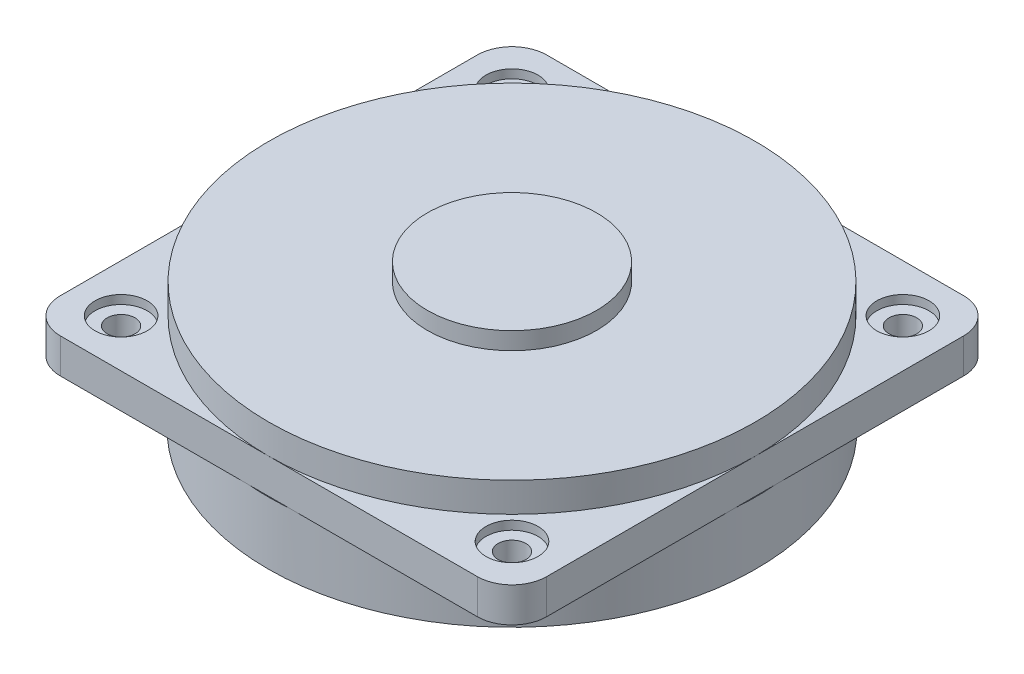
ISO-10303-21;
HEADER;
FILE_DESCRIPTION(('STEP AP214'),'2;1');
FILE_NAME('part.step','',(''),(''),'','','');
FILE_SCHEMA(('AUTOMOTIVE_DESIGN { 1 0 10303 214 1 1 1 1 }'));
ENDSEC;
DATA;
#1=APPLICATION_CONTEXT('core data for automotive mechanical design processes');
#2=APPLICATION_PROTOCOL_DEFINITION('international standard','automotive_design',2000,#1);
#3=PRODUCT_CONTEXT('',#1,'mechanical');
#4=PRODUCT('Part','Part','',(#3));
#5=PRODUCT_RELATED_PRODUCT_CATEGORY('part','',(#4));
#6=PRODUCT_DEFINITION_FORMATION('','',#4);
#7=PRODUCT_DEFINITION_CONTEXT('part definition',#1,'design');
#8=PRODUCT_DEFINITION('design','',#6,#7);
#9=PRODUCT_DEFINITION_SHAPE('','',#8);
#10=(LENGTH_UNIT() NAMED_UNIT(*) SI_UNIT(.MILLI.,.METRE.));
#11=(NAMED_UNIT(*) PLANE_ANGLE_UNIT() SI_UNIT($,.RADIAN.));
#12=(NAMED_UNIT(*) SI_UNIT($,.STERADIAN.) SOLID_ANGLE_UNIT());
#13=UNCERTAINTY_MEASURE_WITH_UNIT(LENGTH_MEASURE(1.E-05),#10,'distance_accuracy_value','');
#14=(GEOMETRIC_REPRESENTATION_CONTEXT(3) GLOBAL_UNCERTAINTY_ASSIGNED_CONTEXT((#13)) GLOBAL_UNIT_ASSIGNED_CONTEXT((#10,
#11,#12)) REPRESENTATION_CONTEXT('',''));
#15=CARTESIAN_POINT('',(0.,0.,0.));
#16=DIRECTION('',(0.,0.,1.));
#17=DIRECTION('',(1.,0.,0.));
#18=AXIS2_PLACEMENT_3D('',#15,#16,#17);
#19=CARTESIAN_POINT('',(0.,2.,0.));
#20=DIRECTION('',(0.,1.,0.));
#21=DIRECTION('',(0.,0.,1.));
#22=AXIS2_PLACEMENT_3D('',#19,#20,#21);
#23=PLANE('',#22);
#24=CARTESIAN_POINT('',(11.25,2.,11.25));
#25=DIRECTION('',(0.,1.,0.));
#26=DIRECTION('',(0.,0.,1.));
#27=AXIS2_PLACEMENT_3D('',#24,#25,#26);
#28=CIRCLE('',#27,1.5);
#29=CARTESIAN_POINT('',(11.25,2.,12.75));
#30=VERTEX_POINT('',#29);
#31=EDGE_CURVE('E239',#30,#30,#28,.T.);
#32=ORIENTED_EDGE('',*,*,#31,.F.);
#33=EDGE_LOOP('',(#32));
#34=FACE_BOUND('',#33,.T.);
#35=DIRECTION('',(1.,0.,0.));
#36=VECTOR('',#35,1.);
#37=CARTESIAN_POINT('',(-14.,2.,14.));
#38=LINE('',#37,#36);
#39=CARTESIAN_POINT('',(0.,2.,14.));
#40=VERTEX_POINT('',#39);
#41=CARTESIAN_POINT('',(12.,2.,14.));
#42=VERTEX_POINT('',#41);
#43=EDGE_CURVE('E150',#40,#42,#38,.T.);
#44=ORIENTED_EDGE('',*,*,#43,.T.);
#45=CARTESIAN_POINT('',(12.,2.,12.));
#46=DIRECTION('',(0.,1.,0.));
#47=DIRECTION('',(0.,0.,1.));
#48=AXIS2_PLACEMENT_3D('',#45,#46,#47);
#49=CIRCLE('',#48,2.);
#50=CARTESIAN_POINT('',(14.,2.,12.));
#51=VERTEX_POINT('',#50);
#52=EDGE_CURVE('E258',#42,#51,#49,.T.);
#53=ORIENTED_EDGE('',*,*,#52,.T.);
#54=DIRECTION('',(0.,0.,-1.));
#55=VECTOR('',#54,1.);
#56=CARTESIAN_POINT('',(14.,2.,-14.));
#57=LINE('',#56,#55);
#58=CARTESIAN_POINT('',(14.,2.,0.));
#59=VERTEX_POINT('',#58);
#60=EDGE_CURVE('E164',#51,#59,#57,.T.);
#61=ORIENTED_EDGE('',*,*,#60,.T.);
#62=CARTESIAN_POINT('',(0.,2.,0.));
#63=DIRECTION('',(0.,1.,0.));
#64=DIRECTION('',(0.,0.,1.));
#65=AXIS2_PLACEMENT_3D('',#62,#63,#64);
#66=CIRCLE('',#65,14.);
#67=EDGE_CURVE('E162',#40,#59,#66,.T.);
#68=ORIENTED_EDGE('',*,*,#67,.F.);
#69=EDGE_LOOP('',(#44,#53,#61,#68));
#70=FACE_BOUND('',#69,.T.);
#71=ADVANCED_FACE('F35',(#34,#70),#23,.T.);
#72=CARTESIAN_POINT('',(11.25,2.,-11.25));
#73=DIRECTION('',(0.,1.,0.));
#74=DIRECTION('',(0.,0.,1.));
#75=AXIS2_PLACEMENT_3D('',#72,#73,#74);
#76=CIRCLE('',#75,1.5);
#77=CARTESIAN_POINT('',(11.25,2.,-9.75));
#78=VERTEX_POINT('',#77);
#79=EDGE_CURVE('E363',#78,#78,#76,.T.);
#80=ORIENTED_EDGE('',*,*,#79,.F.);
#81=EDGE_LOOP('',(#80));
#82=FACE_BOUND('',#81,.T.);
#83=CARTESIAN_POINT('',(14.,2.,-12.));
#84=VERTEX_POINT('',#83);
#85=EDGE_CURVE('E203',#59,#84,#57,.T.);
#86=ORIENTED_EDGE('',*,*,#85,.T.);
#87=CARTESIAN_POINT('',(12.,2.,-12.));
#88=DIRECTION('',(0.,1.,0.));
#89=DIRECTION('',(0.,0.,1.));
#90=AXIS2_PLACEMENT_3D('',#87,#88,#89);
#91=CIRCLE('',#90,2.);
#92=CARTESIAN_POINT('',(12.,2.,-14.));
#93=VERTEX_POINT('',#92);
#94=EDGE_CURVE('E12',#84,#93,#91,.T.);
#95=ORIENTED_EDGE('',*,*,#94,.T.);
#96=DIRECTION('',(-1.,0.,0.));
#97=VECTOR('',#96,1.);
#98=CARTESIAN_POINT('',(-14.,2.,-14.));
#99=LINE('',#98,#97);
#100=CARTESIAN_POINT('',(0.,2.,-14.));
#101=VERTEX_POINT('',#100);
#102=EDGE_CURVE('E204',#93,#101,#99,.T.);
#103=ORIENTED_EDGE('',*,*,#102,.T.);
#104=EDGE_CURVE('E171',#59,#101,#66,.T.);
#105=ORIENTED_EDGE('',*,*,#104,.F.);
#106=EDGE_LOOP('',(#86,#95,#103,#105));
#107=FACE_BOUND('',#106,.T.);
#108=ADVANCED_FACE('F282',(#82,#107),#23,.T.);
#109=CARTESIAN_POINT('',(-11.25,2.,-11.25));
#110=DIRECTION('',(0.,1.,0.));
#111=DIRECTION('',(0.,0.,1.));
#112=AXIS2_PLACEMENT_3D('',#109,#110,#111);
#113=CIRCLE('',#112,1.5);
#114=CARTESIAN_POINT('',(-11.25,2.,-9.75));
#115=VERTEX_POINT('',#114);
#116=EDGE_CURVE('E357',#115,#115,#113,.T.);
#117=ORIENTED_EDGE('',*,*,#116,.F.);
#118=EDGE_LOOP('',(#117));
#119=FACE_BOUND('',#118,.T.);
#120=CARTESIAN_POINT('',(-12.,2.,-14.));
#121=VERTEX_POINT('',#120);
#122=EDGE_CURVE('E202',#101,#121,#99,.T.);
#123=ORIENTED_EDGE('',*,*,#122,.T.);
#124=CARTESIAN_POINT('',(-12.,2.,-12.));
#125=DIRECTION('',(0.,1.,0.));
#126=DIRECTION('',(0.,0.,1.));
#127=AXIS2_PLACEMENT_3D('',#124,#125,#126);
#128=CIRCLE('',#127,2.);
#129=CARTESIAN_POINT('',(-14.,2.,-12.));
#130=VERTEX_POINT('',#129);
#131=EDGE_CURVE('E266',#121,#130,#128,.T.);
#132=ORIENTED_EDGE('',*,*,#131,.T.);
#133=DIRECTION('',(0.,0.,1.));
#134=VECTOR('',#133,1.);
#135=CARTESIAN_POINT('',(-14.,2.,-14.));
#136=LINE('',#135,#134);
#137=CARTESIAN_POINT('',(-14.,2.,0.));
#138=VERTEX_POINT('',#137);
#139=EDGE_CURVE('E160',#130,#138,#136,.T.);
#140=ORIENTED_EDGE('',*,*,#139,.T.);
#141=EDGE_CURVE('E176',#101,#138,#66,.T.);
#142=ORIENTED_EDGE('',*,*,#141,.F.);
#143=EDGE_LOOP('',(#123,#132,#140,#142));
#144=FACE_BOUND('',#143,.T.);
#145=ADVANCED_FACE('F284',(#119,#144),#23,.T.);
#146=CARTESIAN_POINT('',(0.,0.,0.));
#147=DIRECTION('',(0.,1.,0.));
#148=DIRECTION('',(0.,0.,1.));
#149=AXIS2_PLACEMENT_3D('',#146,#147,#148);
#150=PLANE('',#149);
#151=CARTESIAN_POINT('',(11.25,0.,-11.25));
#152=DIRECTION('',(0.,1.,0.));
#153=DIRECTION('',(0.,0.,1.));
#154=AXIS2_PLACEMENT_3D('',#151,#152,#153);
#155=CIRCLE('',#154,0.800000000000001);
#156=CARTESIAN_POINT('',(11.25,0.,-10.45));
#157=VERTEX_POINT('',#156);
#158=EDGE_CURVE('E236',#157,#157,#155,.T.);
#159=ORIENTED_EDGE('',*,*,#158,.T.);
#160=EDGE_LOOP('',(#159));
#161=FACE_BOUND('',#160,.T.);
#162=DIRECTION('',(-1.,0.,0.));
#163=VECTOR('',#162,1.);
#164=CARTESIAN_POINT('',(-14.,0.,-14.));
#165=LINE('',#164,#163);
#166=CARTESIAN_POINT('',(12.,0.,-14.));
#167=VERTEX_POINT('',#166);
#168=CARTESIAN_POINT('',(1.12339886060117,0.,-14.));
#169=VERTEX_POINT('',#168);
#170=EDGE_CURVE('E212',#167,#169,#165,.T.);
#171=ORIENTED_EDGE('',*,*,#170,.F.);
#172=CARTESIAN_POINT('',(12.,0.,-12.));
#173=DIRECTION('',(0.,1.,0.));
#174=DIRECTION('',(0.,0.,1.));
#175=AXIS2_PLACEMENT_3D('',#172,#173,#174);
#176=CIRCLE('',#175,2.);
#177=CARTESIAN_POINT('',(14.,0.,-12.));
#178=VERTEX_POINT('',#177);
#179=EDGE_CURVE('E43',#167,#178,#176,.F.);
#180=ORIENTED_EDGE('',*,*,#179,.T.);
#181=DIRECTION('',(0.,0.,-1.));
#182=VECTOR('',#181,1.);
#183=CARTESIAN_POINT('',(14.,0.,-14.));
#184=LINE('',#183,#182);
#185=CARTESIAN_POINT('',(14.,0.,-1.12339886060117));
#186=VERTEX_POINT('',#185);
#187=EDGE_CURVE('E200',#186,#178,#184,.T.);
#188=ORIENTED_EDGE('',*,*,#187,.F.);
#189=CARTESIAN_POINT('',(0.,0.,0.));
#190=DIRECTION('',(0.,-1.,0.));
#191=DIRECTION('',(0.,0.,-1.));
#192=AXIS2_PLACEMENT_3D('',#189,#190,#191);
#193=CIRCLE('',#192,14.045);
#194=EDGE_CURVE('E188',#169,#186,#193,.T.);
#195=ORIENTED_EDGE('',*,*,#194,.F.);
#196=EDGE_LOOP('',(#171,#180,#188,#195));
#197=FACE_BOUND('',#196,.T.);
#198=ADVANCED_FACE('F270',(#161,#197),#150,.F.);
#199=CARTESIAN_POINT('',(11.25,0.,11.25));
#200=DIRECTION('',(0.,1.,0.));
#201=DIRECTION('',(0.,0.,1.));
#202=AXIS2_PLACEMENT_3D('',#199,#200,#201);
#203=CIRCLE('',#202,0.800000000000001);
#204=CARTESIAN_POINT('',(11.25,0.,12.05));
#205=VERTEX_POINT('',#204);
#206=EDGE_CURVE('E233',#205,#205,#203,.T.);
#207=ORIENTED_EDGE('',*,*,#206,.T.);
#208=EDGE_LOOP('',(#207));
#209=FACE_BOUND('',#208,.T.);
#210=CARTESIAN_POINT('',(14.,0.,12.));
#211=VERTEX_POINT('',#210);
#212=CARTESIAN_POINT('',(14.,0.,1.12339886060117));
#213=VERTEX_POINT('',#212);
#214=EDGE_CURVE('E208',#211,#213,#184,.T.);
#215=ORIENTED_EDGE('',*,*,#214,.F.);
#216=CARTESIAN_POINT('',(12.,0.,12.));
#217=DIRECTION('',(0.,1.,0.));
#218=DIRECTION('',(0.,0.,1.));
#219=AXIS2_PLACEMENT_3D('',#216,#217,#218);
#220=CIRCLE('',#219,2.);
#221=CARTESIAN_POINT('',(12.,0.,14.));
#222=VERTEX_POINT('',#221);
#223=EDGE_CURVE('E256',#211,#222,#220,.F.);
#224=ORIENTED_EDGE('',*,*,#223,.T.);
#225=DIRECTION('',(1.,0.,0.));
#226=VECTOR('',#225,1.);
#227=CARTESIAN_POINT('',(-14.,0.,14.));
#228=LINE('',#227,#226);
#229=CARTESIAN_POINT('',(1.12339886060121,0.,14.));
#230=VERTEX_POINT('',#229);
#231=EDGE_CURVE('E218',#230,#222,#228,.T.);
#232=ORIENTED_EDGE('',*,*,#231,.F.);
#233=EDGE_CURVE('E177',#213,#230,#193,.T.);
#234=ORIENTED_EDGE('',*,*,#233,.F.);
#235=EDGE_LOOP('',(#215,#224,#232,#234));
#236=FACE_BOUND('',#235,.T.);
#237=ADVANCED_FACE('F353',(#209,#236),#150,.F.);
#238=CARTESIAN_POINT('',(-11.25,0.,11.25));
#239=DIRECTION('',(0.,1.,0.));
#240=DIRECTION('',(0.,0.,1.));
#241=AXIS2_PLACEMENT_3D('',#238,#239,#240);
#242=CIRCLE('',#241,0.800000000000001);
#243=CARTESIAN_POINT('',(-11.25,0.,12.05));
#244=VERTEX_POINT('',#243);
#245=EDGE_CURVE('E229',#244,#244,#242,.T.);
#246=ORIENTED_EDGE('',*,*,#245,.T.);
#247=EDGE_LOOP('',(#246));
#248=FACE_BOUND('',#247,.T.);
#249=CARTESIAN_POINT('',(-12.,0.,14.));
#250=VERTEX_POINT('',#249);
#251=CARTESIAN_POINT('',(-1.12339886060121,0.,14.));
#252=VERTEX_POINT('',#251);
#253=EDGE_CURVE('E220',#250,#252,#228,.T.);
#254=ORIENTED_EDGE('',*,*,#253,.F.);
#255=CARTESIAN_POINT('',(-12.,0.,12.));
#256=DIRECTION('',(0.,1.,0.));
#257=DIRECTION('',(0.,0.,1.));
#258=AXIS2_PLACEMENT_3D('',#255,#256,#257);
#259=CIRCLE('',#258,2.);
#260=CARTESIAN_POINT('',(-14.,0.,12.));
#261=VERTEX_POINT('',#260);
#262=EDGE_CURVE('E243',#250,#261,#259,.F.);
#263=ORIENTED_EDGE('',*,*,#262,.T.);
#264=DIRECTION('',(0.,0.,1.));
#265=VECTOR('',#264,1.);
#266=CARTESIAN_POINT('',(-14.,0.,-14.));
#267=LINE('',#266,#265);
#268=CARTESIAN_POINT('',(-14.,0.,1.12339886060117));
#269=VERTEX_POINT('',#268);
#270=EDGE_CURVE('E214',#269,#261,#267,.T.);
#271=ORIENTED_EDGE('',*,*,#270,.F.);
#272=EDGE_CURVE('E179',#252,#269,#193,.T.);
#273=ORIENTED_EDGE('',*,*,#272,.F.);
#274=EDGE_LOOP('',(#254,#263,#271,#273));
#275=FACE_BOUND('',#274,.T.);
#276=ADVANCED_FACE('F407',(#248,#275),#150,.F.);
#277=CARTESIAN_POINT('',(14.,2.,-14.));
#278=DIRECTION('',(-1.,0.,0.));
#279=DIRECTION('',(0.,0.,1.));
#280=AXIS2_PLACEMENT_3D('',#277,#278,#279);
#281=PLANE('',#280);
#282=ORIENTED_EDGE('',*,*,#60,.F.);
#283=DIRECTION('',(0.,-1.,0.));
#284=VECTOR('',#283,1.);
#285=CARTESIAN_POINT('',(14.,2.,12.));
#286=LINE('',#285,#284);
#287=EDGE_CURVE('E253',#51,#211,#286,.T.);
#288=ORIENTED_EDGE('',*,*,#287,.T.);
#289=ORIENTED_EDGE('',*,*,#214,.T.);
#290=EDGE_CURVE('E211',#213,#186,#184,.T.);
#291=ORIENTED_EDGE('',*,*,#290,.T.);
#292=ORIENTED_EDGE('',*,*,#187,.T.);
#293=DIRECTION('',(0.,-1.,0.));
#294=VECTOR('',#293,1.);
#295=CARTESIAN_POINT('',(14.,2.,-12.));
#296=LINE('',#295,#294);
#297=EDGE_CURVE('E251',#178,#84,#296,.F.);
#298=ORIENTED_EDGE('',*,*,#297,.T.);
#299=ORIENTED_EDGE('',*,*,#85,.F.);
#300=EDGE_LOOP('',(#282,#288,#289,#291,#292,#298,#299));
#301=FACE_BOUND('',#300,.T.);
#302=ADVANCED_FACE('F277',(#301),#281,.F.);
#303=CARTESIAN_POINT('',(-14.,2.,-14.));
#304=DIRECTION('',(0.,0.,1.));
#305=DIRECTION('',(1.,0.,0.));
#306=AXIS2_PLACEMENT_3D('',#303,#304,#305);
#307=PLANE('',#306);
#308=CARTESIAN_POINT('',(-1.12339886060117,0.,-14.));
#309=VERTEX_POINT('',#308);
#310=CARTESIAN_POINT('',(-12.,0.,-14.));
#311=VERTEX_POINT('',#310);
#312=EDGE_CURVE('E210',#309,#311,#165,.T.);
#313=ORIENTED_EDGE('',*,*,#312,.T.);
#314=DIRECTION('',(0.,-1.,0.));
#315=VECTOR('',#314,1.);
#316=CARTESIAN_POINT('',(-12.,2.,-14.));
#317=LINE('',#316,#315);
#318=EDGE_CURVE('E56',#311,#121,#317,.F.);
#319=ORIENTED_EDGE('',*,*,#318,.T.);
#320=ORIENTED_EDGE('',*,*,#122,.F.);
#321=ORIENTED_EDGE('',*,*,#102,.F.);
#322=DIRECTION('',(0.,-1.,0.));
#323=VECTOR('',#322,1.);
#324=CARTESIAN_POINT('',(12.,2.,-14.));
#325=LINE('',#324,#323);
#326=EDGE_CURVE('E262',#93,#167,#325,.T.);
#327=ORIENTED_EDGE('',*,*,#326,.T.);
#328=ORIENTED_EDGE('',*,*,#170,.T.);
#329=EDGE_CURVE('E215',#169,#309,#165,.T.);
#330=ORIENTED_EDGE('',*,*,#329,.T.);
#331=EDGE_LOOP('',(#313,#319,#320,#321,#327,#328,#330));
#332=FACE_BOUND('',#331,.T.);
#333=ADVANCED_FACE('F281',(#332),#307,.F.);
#334=CARTESIAN_POINT('',(-14.,2.,-14.));
#335=DIRECTION('',(1.,0.,0.));
#336=DIRECTION('',(0.,0.,-1.));
#337=AXIS2_PLACEMENT_3D('',#334,#335,#336);
#338=PLANE('',#337);
#339=ORIENTED_EDGE('',*,*,#270,.T.);
#340=DIRECTION('',(0.,-1.,0.));
#341=VECTOR('',#340,1.);
#342=CARTESIAN_POINT('',(-14.,2.,12.));
#343=LINE('',#342,#341);
#344=CARTESIAN_POINT('',(-14.,2.,12.));
#345=VERTEX_POINT('',#344);
#346=EDGE_CURVE('E248',#261,#345,#343,.F.);
#347=ORIENTED_EDGE('',*,*,#346,.T.);
#348=EDGE_CURVE('E206',#138,#345,#136,.T.);
#349=ORIENTED_EDGE('',*,*,#348,.F.);
#350=ORIENTED_EDGE('',*,*,#139,.F.);
#351=DIRECTION('',(0.,-1.,0.));
#352=VECTOR('',#351,1.);
#353=CARTESIAN_POINT('',(-14.,2.,-12.));
#354=LINE('',#353,#352);
#355=CARTESIAN_POINT('',(-14.,0.,-12.));
#356=VERTEX_POINT('',#355);
#357=EDGE_CURVE('E245',#130,#356,#354,.T.);
#358=ORIENTED_EDGE('',*,*,#357,.T.);
#359=CARTESIAN_POINT('',(-14.,0.,-1.12339886060117));
#360=VERTEX_POINT('',#359);
#361=EDGE_CURVE('E216',#356,#360,#267,.T.);
#362=ORIENTED_EDGE('',*,*,#361,.T.);
#363=EDGE_CURVE('E219',#360,#269,#267,.T.);
#364=ORIENTED_EDGE('',*,*,#363,.T.);
#365=EDGE_LOOP('',(#339,#347,#349,#350,#358,#362,#364));
#366=FACE_BOUND('',#365,.T.);
#367=ADVANCED_FACE('F290',(#366),#338,.F.);
#368=CARTESIAN_POINT('',(-14.,2.,14.));
#369=DIRECTION('',(0.,0.,-1.));
#370=DIRECTION('',(-1.,0.,0.));
#371=AXIS2_PLACEMENT_3D('',#368,#369,#370);
#372=PLANE('',#371);
#373=CARTESIAN_POINT('',(-12.,2.,14.));
#374=VERTEX_POINT('',#373);
#375=EDGE_CURVE('E137',#374,#40,#38,.T.);
#376=ORIENTED_EDGE('',*,*,#375,.F.);
#377=DIRECTION('',(0.,-1.,0.));
#378=VECTOR('',#377,1.);
#379=CARTESIAN_POINT('',(-12.,2.,14.));
#380=LINE('',#379,#378);
#381=EDGE_CURVE('E241',#374,#250,#380,.T.);
#382=ORIENTED_EDGE('',*,*,#381,.T.);
#383=ORIENTED_EDGE('',*,*,#253,.T.);
#384=EDGE_CURVE('E222',#252,#230,#228,.T.);
#385=ORIENTED_EDGE('',*,*,#384,.T.);
#386=ORIENTED_EDGE('',*,*,#231,.T.);
#387=DIRECTION('',(0.,-1.,0.));
#388=VECTOR('',#387,1.);
#389=CARTESIAN_POINT('',(12.,2.,14.));
#390=LINE('',#389,#388);
#391=EDGE_CURVE('E157',#222,#42,#390,.F.);
#392=ORIENTED_EDGE('',*,*,#391,.T.);
#393=ORIENTED_EDGE('',*,*,#43,.F.);
#394=EDGE_LOOP('',(#376,#382,#383,#385,#386,#392,#393));
#395=FACE_BOUND('',#394,.T.);
#396=ADVANCED_FACE('F154',(#395),#372,.F.);
#397=CARTESIAN_POINT('',(-11.25,2.,11.25));
#398=DIRECTION('',(0.,1.,0.));
#399=DIRECTION('',(0.,0.,1.));
#400=AXIS2_PLACEMENT_3D('',#397,#398,#399);
#401=CIRCLE('',#400,1.5);
#402=CARTESIAN_POINT('',(-11.25,2.,12.75));
#403=VERTEX_POINT('',#402);
#404=EDGE_CURVE('E366',#403,#403,#401,.T.);
#405=ORIENTED_EDGE('',*,*,#404,.F.);
#406=EDGE_LOOP('',(#405));
#407=FACE_BOUND('',#406,.T.);
#408=ORIENTED_EDGE('',*,*,#348,.T.);
#409=CARTESIAN_POINT('',(-12.,2.,12.));
#410=DIRECTION('',(0.,1.,0.));
#411=DIRECTION('',(0.,0.,1.));
#412=AXIS2_PLACEMENT_3D('',#409,#410,#411);
#413=CIRCLE('',#412,2.);
#414=EDGE_CURVE('E145',#345,#374,#413,.T.);
#415=ORIENTED_EDGE('',*,*,#414,.T.);
#416=ORIENTED_EDGE('',*,*,#375,.T.);
#417=EDGE_CURVE('E142',#138,#40,#66,.T.);
#418=ORIENTED_EDGE('',*,*,#417,.F.);
#419=EDGE_LOOP('',(#408,#415,#416,#418));
#420=FACE_BOUND('',#419,.T.);
#421=ADVANCED_FACE('F140',(#407,#420),#23,.T.);
#422=CARTESIAN_POINT('',(-11.25,0.,-11.25));
#423=DIRECTION('',(0.,1.,0.));
#424=DIRECTION('',(0.,0.,1.));
#425=AXIS2_PLACEMENT_3D('',#422,#423,#424);
#426=CIRCLE('',#425,0.800000000000001);
#427=CARTESIAN_POINT('',(-11.25,0.,-10.45));
#428=VERTEX_POINT('',#427);
#429=EDGE_CURVE('E226',#428,#428,#426,.T.);
#430=ORIENTED_EDGE('',*,*,#429,.T.);
#431=EDGE_LOOP('',(#430));
#432=FACE_BOUND('',#431,.T.);
#433=ORIENTED_EDGE('',*,*,#361,.F.);
#434=CARTESIAN_POINT('',(-12.,0.,-12.));
#435=DIRECTION('',(0.,1.,0.));
#436=DIRECTION('',(0.,0.,1.));
#437=AXIS2_PLACEMENT_3D('',#434,#435,#436);
#438=CIRCLE('',#437,2.);
#439=EDGE_CURVE('E260',#356,#311,#438,.F.);
#440=ORIENTED_EDGE('',*,*,#439,.T.);
#441=ORIENTED_EDGE('',*,*,#312,.F.);
#442=EDGE_CURVE('E149',#360,#309,#193,.T.);
#443=ORIENTED_EDGE('',*,*,#442,.F.);
#444=EDGE_LOOP('',(#433,#440,#441,#443));
#445=FACE_BOUND('',#444,.T.);
#446=ADVANCED_FACE('F296',(#432,#445),#150,.F.);
#447=CARTESIAN_POINT('',(0.,0.,0.));
#448=DIRECTION('',(0.,-1.,0.));
#449=DIRECTION('',(0.,0.,-1.));
#450=AXIS2_PLACEMENT_3D('',#447,#448,#449);
#451=PLANE('',#450);
#452=ORIENTED_EDGE('',*,*,#290,.F.);
#453=EDGE_CURVE('E181',#186,#213,#193,.T.);
#454=ORIENTED_EDGE('',*,*,#453,.F.);
#455=EDGE_LOOP('',(#452,#454));
#456=FACE_BOUND('',#455,.T.);
#457=ADVANCED_FACE('F316',(#456),#451,.F.);
#458=ORIENTED_EDGE('',*,*,#384,.F.);
#459=EDGE_CURVE('E309',#230,#252,#193,.T.);
#460=ORIENTED_EDGE('',*,*,#459,.F.);
#461=EDGE_LOOP('',(#458,#460));
#462=FACE_BOUND('',#461,.T.);
#463=ADVANCED_FACE('F318',(#462),#451,.F.);
#464=ORIENTED_EDGE('',*,*,#363,.F.);
#465=EDGE_CURVE('E308',#269,#360,#193,.T.);
#466=ORIENTED_EDGE('',*,*,#465,.F.);
#467=EDGE_LOOP('',(#464,#466));
#468=FACE_BOUND('',#467,.T.);
#469=ADVANCED_FACE('F324',(#468),#451,.F.);
#470=ORIENTED_EDGE('',*,*,#329,.F.);
#471=EDGE_CURVE('E192',#309,#169,#193,.T.);
#472=ORIENTED_EDGE('',*,*,#471,.F.);
#473=EDGE_LOOP('',(#470,#472));
#474=FACE_BOUND('',#473,.T.);
#475=ADVANCED_FACE('F302',(#474),#451,.F.);
#476=CARTESIAN_POINT('',(0.,-48.9252589670602,0.));
#477=DIRECTION('',(0.,1.,0.));
#478=DIRECTION('',(0.,0.,1.));
#479=AXIS2_PLACEMENT_3D('',#476,#477,#478);
#480=CYLINDRICAL_SURFACE('',#479,14.045);
#481=CARTESIAN_POINT('',(0.,-3.6,0.));
#482=DIRECTION('',(0.,1.,0.));
#483=DIRECTION('',(0.,0.,1.));
#484=AXIS2_PLACEMENT_3D('',#481,#482,#483);
#485=CIRCLE('',#484,14.045);
#486=CARTESIAN_POINT('',(0.,-3.6,14.045));
#487=VERTEX_POINT('',#486);
#488=EDGE_CURVE('E195',#487,#487,#485,.T.);
#489=ORIENTED_EDGE('',*,*,#488,.T.);
#490=EDGE_LOOP('',(#489));
#491=FACE_BOUND('',#490,.T.);
#492=ORIENTED_EDGE('',*,*,#194,.T.);
#493=ORIENTED_EDGE('',*,*,#453,.T.);
#494=ORIENTED_EDGE('',*,*,#233,.T.);
#495=ORIENTED_EDGE('',*,*,#459,.T.);
#496=ORIENTED_EDGE('',*,*,#272,.T.);
#497=ORIENTED_EDGE('',*,*,#465,.T.);
#498=ORIENTED_EDGE('',*,*,#442,.T.);
#499=ORIENTED_EDGE('',*,*,#471,.T.);
#500=EDGE_LOOP('',(#492,#493,#494,#495,#496,#497,#498,#499));
#501=FACE_BOUND('',#500,.T.);
#502=ADVANCED_FACE('F305',(#491,#501),#480,.T.);
#503=CARTESIAN_POINT('',(0.,-48.9252589670602,0.));
#504=DIRECTION('',(0.,1.,0.));
#505=DIRECTION('',(0.,0.,1.));
#506=AXIS2_PLACEMENT_3D('',#503,#504,#505);
#507=CYLINDRICAL_SURFACE('',#506,12.545);
#508=CARTESIAN_POINT('',(0.,-3.6,0.));
#509=DIRECTION('',(0.,1.,0.));
#510=DIRECTION('',(0.,0.,1.));
#511=AXIS2_PLACEMENT_3D('',#508,#509,#510);
#512=CIRCLE('',#511,12.545);
#513=CARTESIAN_POINT('',(0.,-3.6,12.545));
#514=VERTEX_POINT('',#513);
#515=EDGE_CURVE('E191',#514,#514,#512,.T.);
#516=ORIENTED_EDGE('',*,*,#515,.F.);
#517=EDGE_LOOP('',(#516));
#518=FACE_BOUND('',#517,.T.);
#519=CARTESIAN_POINT('',(0.,0.,0.));
#520=DIRECTION('',(0.,-1.,0.));
#521=DIRECTION('',(0.,0.,-1.));
#522=AXIS2_PLACEMENT_3D('',#519,#520,#521);
#523=CIRCLE('',#522,12.545);
#524=CARTESIAN_POINT('',(0.,0.,-12.545));
#525=VERTEX_POINT('',#524);
#526=EDGE_CURVE('E187',#525,#525,#523,.T.);
#527=ORIENTED_EDGE('',*,*,#526,.F.);
#528=EDGE_LOOP('',(#527));
#529=FACE_BOUND('',#528,.T.);
#530=ADVANCED_FACE('F518',(#518,#529),#507,.F.);
#531=CARTESIAN_POINT('',(0.,-3.6,0.));
#532=DIRECTION('',(0.,1.,0.));
#533=DIRECTION('',(0.,0.,1.));
#534=AXIS2_PLACEMENT_3D('',#531,#532,#533);
#535=PLANE('',#534);
#536=ORIENTED_EDGE('',*,*,#515,.T.);
#537=EDGE_LOOP('',(#536));
#538=FACE_BOUND('',#537,.T.);
#539=ORIENTED_EDGE('',*,*,#488,.F.);
#540=EDGE_LOOP('',(#539));
#541=FACE_BOUND('',#540,.T.);
#542=ADVANCED_FACE('F405',(#538,#541),#535,.F.);
#543=CARTESIAN_POINT('',(0.,0.,0.));
#544=DIRECTION('',(0.,1.,0.));
#545=DIRECTION('',(0.,0.,1.));
#546=AXIS2_PLACEMENT_3D('',#543,#544,#545);
#547=CIRCLE('',#546,7.56923738223464);
#548=CARTESIAN_POINT('',(0.,0.,7.56923738223464));
#549=VERTEX_POINT('',#548);
#550=EDGE_CURVE('E223',#549,#549,#547,.F.);
#551=ORIENTED_EDGE('',*,*,#550,.F.);
#552=EDGE_LOOP('',(#551));
#553=FACE_BOUND('',#552,.T.);
#554=ORIENTED_EDGE('',*,*,#526,.T.);
#555=EDGE_LOOP('',(#554));
#556=FACE_BOUND('',#555,.T.);
#557=ADVANCED_FACE('F328',(#553,#556),#150,.F.);
#558=CARTESIAN_POINT('',(0.,50.5979797464467,0.));
#559=DIRECTION('',(0.,-1.,0.));
#560=DIRECTION('',(0.,0.,-1.));
#561=AXIS2_PLACEMENT_3D('',#558,#559,#560);
#562=CYLINDRICAL_SURFACE('',#561,14.);
#563=ORIENTED_EDGE('',*,*,#67,.T.);
#564=ORIENTED_EDGE('',*,*,#104,.T.);
#565=ORIENTED_EDGE('',*,*,#141,.T.);
#566=ORIENTED_EDGE('',*,*,#417,.T.);
#567=EDGE_LOOP('',(#563,#564,#565,#566));
#568=FACE_BOUND('',#567,.T.);
#569=CARTESIAN_POINT('',(0.,3.7,0.));
#570=DIRECTION('',(0.,1.,0.));
#571=DIRECTION('',(0.,0.,1.));
#572=AXIS2_PLACEMENT_3D('',#569,#570,#571);
#573=CIRCLE('',#572,14.);
#574=CARTESIAN_POINT('',(0.,3.7,14.));
#575=VERTEX_POINT('',#574);
#576=EDGE_CURVE('E168',#575,#575,#573,.T.);
#577=ORIENTED_EDGE('',*,*,#576,.F.);
#578=EDGE_LOOP('',(#577));
#579=FACE_BOUND('',#578,.T.);
#580=ADVANCED_FACE('F173',(#568,#579),#562,.T.);
#581=CARTESIAN_POINT('',(0.,3.7,0.));
#582=DIRECTION('',(0.,1.,0.));
#583=DIRECTION('',(0.,0.,1.));
#584=AXIS2_PLACEMENT_3D('',#581,#582,#583);
#585=PLANE('',#584);
#586=CARTESIAN_POINT('',(0.,3.7,0.));
#587=DIRECTION('',(0.,1.,0.));
#588=DIRECTION('',(0.,0.,1.));
#589=AXIS2_PLACEMENT_3D('',#586,#587,#588);
#590=CIRCLE('',#589,4.86954279632585);
#591=CARTESIAN_POINT('',(0.,3.7,4.86954279632585));
#592=VERTEX_POINT('',#591);
#593=EDGE_CURVE('E184',#592,#592,#590,.T.);
#594=ORIENTED_EDGE('',*,*,#593,.F.);
#595=EDGE_LOOP('',(#594));
#596=FACE_BOUND('',#595,.T.);
#597=ORIENTED_EDGE('',*,*,#576,.T.);
#598=EDGE_LOOP('',(#597));
#599=FACE_BOUND('',#598,.T.);
#600=ADVANCED_FACE('F392',(#596,#599),#585,.T.);
#601=CARTESIAN_POINT('',(0.,4.7,0.));
#602=DIRECTION('',(0.,-1.,0.));
#603=DIRECTION('',(0.,0.,-1.));
#604=AXIS2_PLACEMENT_3D('',#601,#602,#603);
#605=CYLINDRICAL_SURFACE('',#604,4.86954279632585);
#606=CARTESIAN_POINT('',(0.,4.7,0.));
#607=DIRECTION('',(0.,1.,0.));
#608=DIRECTION('',(0.,0.,1.));
#609=AXIS2_PLACEMENT_3D('',#606,#607,#608);
#610=CIRCLE('',#609,4.86954279632585);
#611=CARTESIAN_POINT('',(0.,4.7,4.86954279632585));
#612=VERTEX_POINT('',#611);
#613=EDGE_CURVE('E169',#612,#612,#610,.T.);
#614=ORIENTED_EDGE('',*,*,#613,.F.);
#615=EDGE_LOOP('',(#614));
#616=FACE_BOUND('',#615,.T.);
#617=ORIENTED_EDGE('',*,*,#593,.T.);
#618=EDGE_LOOP('',(#617));
#619=FACE_BOUND('',#618,.T.);
#620=ADVANCED_FACE('F389',(#616,#619),#605,.T.);
#621=CARTESIAN_POINT('',(0.,4.7,0.));
#622=DIRECTION('',(0.,1.,0.));
#623=DIRECTION('',(0.,0.,1.));
#624=AXIS2_PLACEMENT_3D('',#621,#622,#623);
#625=PLANE('',#624);
#626=ORIENTED_EDGE('',*,*,#613,.T.);
#627=EDGE_LOOP('',(#626));
#628=FACE_BOUND('',#627,.T.);
#629=ADVANCED_FACE('F387',(#628),#625,.T.);
#630=CARTESIAN_POINT('',(0.,-25.0090363255553,0.));
#631=DIRECTION('',(0.,1.,0.));
#632=DIRECTION('',(0.,0.,1.));
#633=AXIS2_PLACEMENT_3D('',#630,#631,#632);
#634=CYLINDRICAL_SURFACE('',#633,7.56923738223464);
#635=CARTESIAN_POINT('',(0.,-3.6,0.));
#636=DIRECTION('',(0.,1.,0.));
#637=DIRECTION('',(0.,0.,1.));
#638=AXIS2_PLACEMENT_3D('',#635,#636,#637);
#639=CIRCLE('',#638,7.56923738223464);
#640=CARTESIAN_POINT('',(0.,-3.6,7.56923738223464));
#641=VERTEX_POINT('',#640);
#642=EDGE_CURVE('E380',#641,#641,#639,.T.);
#643=ORIENTED_EDGE('',*,*,#642,.T.);
#644=EDGE_LOOP('',(#643));
#645=FACE_BOUND('',#644,.T.);
#646=ORIENTED_EDGE('',*,*,#550,.T.);
#647=EDGE_LOOP('',(#646));
#648=FACE_BOUND('',#647,.T.);
#649=ADVANCED_FACE('F411',(#645,#648),#634,.T.);
#650=CARTESIAN_POINT('',(0.,-3.6,0.));
#651=DIRECTION('',(0.,1.,0.));
#652=DIRECTION('',(0.,0.,1.));
#653=AXIS2_PLACEMENT_3D('',#650,#651,#652);
#654=PLANE('',#653);
#655=ORIENTED_EDGE('',*,*,#642,.F.);
#656=EDGE_LOOP('',(#655));
#657=FACE_BOUND('',#656,.T.);
#658=ADVANCED_FACE('F414',(#657),#654,.F.);
#659=CARTESIAN_POINT('',(-11.25,1.5,11.25));
#660=DIRECTION('',(0.,1.,0.));
#661=DIRECTION('',(0.,0.,1.));
#662=AXIS2_PLACEMENT_3D('',#659,#660,#661);
#663=CYLINDRICAL_SURFACE('',#662,1.5);
#664=CARTESIAN_POINT('',(-11.25,1.5,11.25));
#665=DIRECTION('',(0.,1.,0.));
#666=DIRECTION('',(0.,0.,1.));
#667=AXIS2_PLACEMENT_3D('',#664,#665,#666);
#668=CIRCLE('',#667,1.5);
#669=CARTESIAN_POINT('',(-11.25,1.5,12.75));
#670=VERTEX_POINT('',#669);
#671=EDGE_CURVE('E360',#670,#670,#668,.T.);
#672=ORIENTED_EDGE('',*,*,#671,.F.);
#673=EDGE_LOOP('',(#672));
#674=FACE_BOUND('',#673,.T.);
#675=ORIENTED_EDGE('',*,*,#404,.T.);
#676=EDGE_LOOP('',(#675));
#677=FACE_BOUND('',#676,.T.);
#678=ADVANCED_FACE('F418',(#674,#677),#663,.F.);
#679=CARTESIAN_POINT('',(-11.25,1.5,11.25));
#680=DIRECTION('',(0.,1.,0.));
#681=DIRECTION('',(0.,0.,1.));
#682=AXIS2_PLACEMENT_3D('',#679,#680,#681);
#683=PLANE('',#682);
#684=CARTESIAN_POINT('',(-11.25,1.5,11.25));
#685=DIRECTION('',(0.,1.,0.));
#686=DIRECTION('',(0.,0.,1.));
#687=AXIS2_PLACEMENT_3D('',#684,#685,#686);
#688=CIRCLE('',#687,0.800000000000001);
#689=CARTESIAN_POINT('',(-11.25,1.5,12.05));
#690=VERTEX_POINT('',#689);
#691=EDGE_CURVE('E482',#690,#690,#688,.T.);
#692=ORIENTED_EDGE('',*,*,#691,.F.);
#693=EDGE_LOOP('',(#692));
#694=FACE_BOUND('',#693,.T.);
#695=ORIENTED_EDGE('',*,*,#671,.T.);
#696=EDGE_LOOP('',(#695));
#697=FACE_BOUND('',#696,.T.);
#698=ADVANCED_FACE('F440',(#694,#697),#683,.T.);
#699=CARTESIAN_POINT('',(-11.25,1.5,-11.25));
#700=DIRECTION('',(0.,1.,0.));
#701=DIRECTION('',(0.,0.,1.));
#702=AXIS2_PLACEMENT_3D('',#699,#700,#701);
#703=CYLINDRICAL_SURFACE('',#702,1.5);
#704=CARTESIAN_POINT('',(-11.25,1.5,-11.25));
#705=DIRECTION('',(0.,1.,0.));
#706=DIRECTION('',(0.,0.,1.));
#707=AXIS2_PLACEMENT_3D('',#704,#705,#706);
#708=CIRCLE('',#707,1.5);
#709=CARTESIAN_POINT('',(-11.25,1.5,-9.75));
#710=VERTEX_POINT('',#709);
#711=EDGE_CURVE('E359',#710,#710,#708,.T.);
#712=ORIENTED_EDGE('',*,*,#711,.F.);
#713=EDGE_LOOP('',(#712));
#714=FACE_BOUND('',#713,.T.);
#715=ORIENTED_EDGE('',*,*,#116,.T.);
#716=EDGE_LOOP('',(#715));
#717=FACE_BOUND('',#716,.T.);
#718=ADVANCED_FACE('F444',(#714,#717),#703,.F.);
#719=CARTESIAN_POINT('',(-11.25,1.5,-11.25));
#720=DIRECTION('',(0.,1.,0.));
#721=DIRECTION('',(0.,0.,1.));
#722=AXIS2_PLACEMENT_3D('',#719,#720,#721);
#723=PLANE('',#722);
#724=CARTESIAN_POINT('',(-11.25,1.5,-11.25));
#725=DIRECTION('',(0.,1.,0.));
#726=DIRECTION('',(0.,0.,1.));
#727=AXIS2_PLACEMENT_3D('',#724,#725,#726);
#728=CIRCLE('',#727,0.800000000000001);
#729=CARTESIAN_POINT('',(-11.25,1.5,-10.45));
#730=VERTEX_POINT('',#729);
#731=EDGE_CURVE('E230',#730,#730,#728,.T.);
#732=ORIENTED_EDGE('',*,*,#731,.F.);
#733=EDGE_LOOP('',(#732));
#734=FACE_BOUND('',#733,.T.);
#735=ORIENTED_EDGE('',*,*,#711,.T.);
#736=EDGE_LOOP('',(#735));
#737=FACE_BOUND('',#736,.T.);
#738=ADVANCED_FACE('F424',(#734,#737),#723,.T.);
#739=CARTESIAN_POINT('',(11.25,1.5,-11.25));
#740=DIRECTION('',(0.,1.,0.));
#741=DIRECTION('',(0.,0.,1.));
#742=AXIS2_PLACEMENT_3D('',#739,#740,#741);
#743=CYLINDRICAL_SURFACE('',#742,1.5);
#744=CARTESIAN_POINT('',(11.25,1.5,-11.25));
#745=DIRECTION('',(0.,1.,0.));
#746=DIRECTION('',(0.,0.,1.));
#747=AXIS2_PLACEMENT_3D('',#744,#745,#746);
#748=CIRCLE('',#747,1.5);
#749=CARTESIAN_POINT('',(11.25,1.5,-9.75));
#750=VERTEX_POINT('',#749);
#751=EDGE_CURVE('E377',#750,#750,#748,.T.);
#752=ORIENTED_EDGE('',*,*,#751,.F.);
#753=EDGE_LOOP('',(#752));
#754=FACE_BOUND('',#753,.T.);
#755=ORIENTED_EDGE('',*,*,#79,.T.);
#756=EDGE_LOOP('',(#755));
#757=FACE_BOUND('',#756,.T.);
#758=ADVANCED_FACE('F420',(#754,#757),#743,.F.);
#759=CARTESIAN_POINT('',(11.25,1.5,-11.25));
#760=DIRECTION('',(0.,1.,0.));
#761=DIRECTION('',(0.,0.,1.));
#762=AXIS2_PLACEMENT_3D('',#759,#760,#761);
#763=PLANE('',#762);
#764=CARTESIAN_POINT('',(11.25,1.5,-11.25));
#765=DIRECTION('',(0.,1.,0.));
#766=DIRECTION('',(0.,0.,1.));
#767=AXIS2_PLACEMENT_3D('',#764,#765,#766);
#768=CIRCLE('',#767,0.800000000000001);
#769=CARTESIAN_POINT('',(11.25,1.5,-10.45));
#770=VERTEX_POINT('',#769);
#771=EDGE_CURVE('E476',#770,#770,#768,.T.);
#772=ORIENTED_EDGE('',*,*,#771,.F.);
#773=EDGE_LOOP('',(#772));
#774=FACE_BOUND('',#773,.T.);
#775=ORIENTED_EDGE('',*,*,#751,.T.);
#776=EDGE_LOOP('',(#775));
#777=FACE_BOUND('',#776,.T.);
#778=ADVANCED_FACE('F423',(#774,#777),#763,.T.);
#779=CARTESIAN_POINT('',(11.25,1.5,11.25));
#780=DIRECTION('',(0.,1.,0.));
#781=DIRECTION('',(0.,0.,1.));
#782=AXIS2_PLACEMENT_3D('',#779,#780,#781);
#783=CYLINDRICAL_SURFACE('',#782,1.5);
#784=CARTESIAN_POINT('',(11.25,1.5,11.25));
#785=DIRECTION('',(0.,1.,0.));
#786=DIRECTION('',(0.,0.,1.));
#787=AXIS2_PLACEMENT_3D('',#784,#785,#786);
#788=CIRCLE('',#787,1.5);
#789=CARTESIAN_POINT('',(11.25,1.5,12.75));
#790=VERTEX_POINT('',#789);
#791=EDGE_CURVE('E372',#790,#790,#788,.T.);
#792=ORIENTED_EDGE('',*,*,#791,.F.);
#793=EDGE_LOOP('',(#792));
#794=FACE_BOUND('',#793,.T.);
#795=ORIENTED_EDGE('',*,*,#31,.T.);
#796=EDGE_LOOP('',(#795));
#797=FACE_BOUND('',#796,.T.);
#798=ADVANCED_FACE('F428',(#794,#797),#783,.F.);
#799=CARTESIAN_POINT('',(11.25,1.5,11.25));
#800=DIRECTION('',(0.,1.,0.));
#801=DIRECTION('',(0.,0.,1.));
#802=AXIS2_PLACEMENT_3D('',#799,#800,#801);
#803=PLANE('',#802);
#804=CARTESIAN_POINT('',(11.25,1.5,11.25));
#805=DIRECTION('',(0.,1.,0.));
#806=DIRECTION('',(0.,0.,1.));
#807=AXIS2_PLACEMENT_3D('',#804,#805,#806);
#808=CIRCLE('',#807,0.800000000000001);
#809=CARTESIAN_POINT('',(11.25,1.5,12.05));
#810=VERTEX_POINT('',#809);
#811=EDGE_CURVE('E478',#810,#810,#808,.T.);
#812=ORIENTED_EDGE('',*,*,#811,.F.);
#813=EDGE_LOOP('',(#812));
#814=FACE_BOUND('',#813,.T.);
#815=ORIENTED_EDGE('',*,*,#791,.T.);
#816=EDGE_LOOP('',(#815));
#817=FACE_BOUND('',#816,.T.);
#818=ADVANCED_FACE('F432',(#814,#817),#803,.T.);
#819=CARTESIAN_POINT('',(-11.25,-3.6,-11.25));
#820=DIRECTION('',(0.,1.,0.));
#821=DIRECTION('',(0.,0.,1.));
#822=AXIS2_PLACEMENT_3D('',#819,#820,#821);
#823=CYLINDRICAL_SURFACE('',#822,0.800000000000001);
#824=ORIENTED_EDGE('',*,*,#731,.T.);
#825=EDGE_LOOP('',(#824));
#826=FACE_BOUND('',#825,.T.);
#827=ORIENTED_EDGE('',*,*,#429,.F.);
#828=EDGE_LOOP('',(#827));
#829=FACE_BOUND('',#828,.T.);
#830=ADVANCED_FACE('F436',(#826,#829),#823,.F.);
#831=CARTESIAN_POINT('',(-11.25,-3.6,11.25));
#832=DIRECTION('',(0.,1.,0.));
#833=DIRECTION('',(0.,0.,1.));
#834=AXIS2_PLACEMENT_3D('',#831,#832,#833);
#835=CYLINDRICAL_SURFACE('',#834,0.800000000000001);
#836=ORIENTED_EDGE('',*,*,#691,.T.);
#837=EDGE_LOOP('',(#836));
#838=FACE_BOUND('',#837,.T.);
#839=ORIENTED_EDGE('',*,*,#245,.F.);
#840=EDGE_LOOP('',(#839));
#841=FACE_BOUND('',#840,.T.);
#842=ADVANCED_FACE('F454',(#838,#841),#835,.F.);
#843=CARTESIAN_POINT('',(11.25,-3.6,11.25));
#844=DIRECTION('',(0.,1.,0.));
#845=DIRECTION('',(0.,0.,1.));
#846=AXIS2_PLACEMENT_3D('',#843,#844,#845);
#847=CYLINDRICAL_SURFACE('',#846,0.800000000000001);
#848=ORIENTED_EDGE('',*,*,#811,.T.);
#849=EDGE_LOOP('',(#848));
#850=FACE_BOUND('',#849,.T.);
#851=ORIENTED_EDGE('',*,*,#206,.F.);
#852=EDGE_LOOP('',(#851));
#853=FACE_BOUND('',#852,.T.);
#854=ADVANCED_FACE('F458',(#850,#853),#847,.F.);
#855=CARTESIAN_POINT('',(11.25,-3.6,-11.25));
#856=DIRECTION('',(0.,1.,0.));
#857=DIRECTION('',(0.,0.,1.));
#858=AXIS2_PLACEMENT_3D('',#855,#856,#857);
#859=CYLINDRICAL_SURFACE('',#858,0.800000000000001);
#860=ORIENTED_EDGE('',*,*,#771,.T.);
#861=EDGE_LOOP('',(#860));
#862=FACE_BOUND('',#861,.T.);
#863=ORIENTED_EDGE('',*,*,#158,.F.);
#864=EDGE_LOOP('',(#863));
#865=FACE_BOUND('',#864,.T.);
#866=ADVANCED_FACE('F462',(#862,#865),#859,.F.);
#867=CARTESIAN_POINT('',(-12.,2.,12.));
#868=DIRECTION('',(0.,-1.,0.));
#869=DIRECTION('',(0.,0.,-1.));
#870=AXIS2_PLACEMENT_3D('',#867,#868,#869);
#871=CYLINDRICAL_SURFACE('',#870,2.);
#872=ORIENTED_EDGE('',*,*,#414,.F.);
#873=ORIENTED_EDGE('',*,*,#346,.F.);
#874=ORIENTED_EDGE('',*,*,#262,.F.);
#875=ORIENTED_EDGE('',*,*,#381,.F.);
#876=EDGE_LOOP('',(#872,#873,#874,#875));
#877=FACE_BOUND('',#876,.T.);
#878=ADVANCED_FACE('F465',(#877),#871,.T.);
#879=CARTESIAN_POINT('',(12.,2.,12.));
#880=DIRECTION('',(0.,-1.,0.));
#881=DIRECTION('',(0.,0.,-1.));
#882=AXIS2_PLACEMENT_3D('',#879,#880,#881);
#883=CYLINDRICAL_SURFACE('',#882,2.);
#884=ORIENTED_EDGE('',*,*,#52,.F.);
#885=ORIENTED_EDGE('',*,*,#391,.F.);
#886=ORIENTED_EDGE('',*,*,#223,.F.);
#887=ORIENTED_EDGE('',*,*,#287,.F.);
#888=EDGE_LOOP('',(#884,#885,#886,#887));
#889=FACE_BOUND('',#888,.T.);
#890=ADVANCED_FACE('F470',(#889),#883,.T.);
#891=CARTESIAN_POINT('',(-12.,2.,-12.));
#892=DIRECTION('',(0.,-1.,0.));
#893=DIRECTION('',(0.,0.,-1.));
#894=AXIS2_PLACEMENT_3D('',#891,#892,#893);
#895=CYLINDRICAL_SURFACE('',#894,2.);
#896=ORIENTED_EDGE('',*,*,#131,.F.);
#897=ORIENTED_EDGE('',*,*,#318,.F.);
#898=ORIENTED_EDGE('',*,*,#439,.F.);
#899=ORIENTED_EDGE('',*,*,#357,.F.);
#900=EDGE_LOOP('',(#896,#897,#898,#899));
#901=FACE_BOUND('',#900,.T.);
#902=ADVANCED_FACE('F293',(#901),#895,.T.);
#903=CARTESIAN_POINT('',(12.,2.,-12.));
#904=DIRECTION('',(0.,-1.,0.));
#905=DIRECTION('',(0.,0.,-1.));
#906=AXIS2_PLACEMENT_3D('',#903,#904,#905);
#907=CYLINDRICAL_SURFACE('',#906,2.);
#908=ORIENTED_EDGE('',*,*,#94,.F.);
#909=ORIENTED_EDGE('',*,*,#297,.F.);
#910=ORIENTED_EDGE('',*,*,#179,.F.);
#911=ORIENTED_EDGE('',*,*,#326,.F.);
#912=EDGE_LOOP('',(#908,#909,#910,#911));
#913=FACE_BOUND('',#912,.T.);
#914=ADVANCED_FACE('F37',(#913),#907,.T.);
#915=CLOSED_SHELL('',(#71,#108,#145,#198,#237,#276,#302,#333,#367,#396,#421,#446,#457,#463,#469,
#475,#502,#530,#542,#557,#580,#600,#620,#629,#649,#658,#678,#698,#718,#738,#758,#778,#798,#818,
#830,#842,#854,#866,#878,#890,#902,#914));
#916=MANIFOLD_SOLID_BREP('B2',#915);
#917=ADVANCED_BREP_SHAPE_REPRESENTATION('',(#18,#916),#14);
#918=SHAPE_DEFINITION_REPRESENTATION(#9,#917);
ENDSEC;
END-ISO-10303-21;
